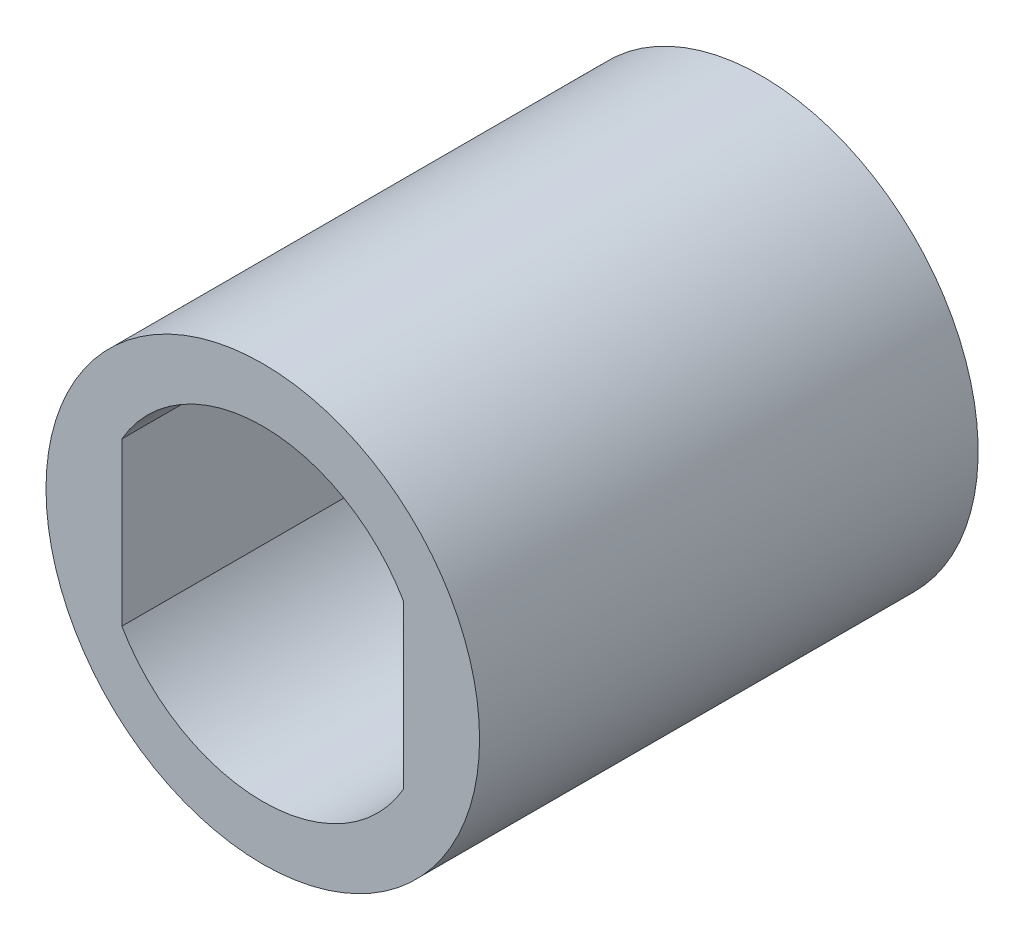
ISO-10303-21;
HEADER;
FILE_DESCRIPTION(('STEP AP214'),'2;1');
FILE_NAME('part.step','',(''),(''),'','','');
FILE_SCHEMA(('AUTOMOTIVE_DESIGN { 1 0 10303 214 1 1 1 1 }'));
ENDSEC;
DATA;
#1=APPLICATION_CONTEXT('core data for automotive mechanical design processes');
#2=APPLICATION_PROTOCOL_DEFINITION('international standard','automotive_design',2000,#1);
#3=PRODUCT_CONTEXT('',#1,'mechanical');
#4=PRODUCT('Part','Part','',(#3));
#5=PRODUCT_RELATED_PRODUCT_CATEGORY('part','',(#4));
#6=PRODUCT_DEFINITION_FORMATION('','',#4);
#7=PRODUCT_DEFINITION_CONTEXT('part definition',#1,'design');
#8=PRODUCT_DEFINITION('design','',#6,#7);
#9=PRODUCT_DEFINITION_SHAPE('','',#8);
#10=(LENGTH_UNIT() NAMED_UNIT(*) SI_UNIT(.MILLI.,.METRE.));
#11=(NAMED_UNIT(*) PLANE_ANGLE_UNIT() SI_UNIT($,.RADIAN.));
#12=(NAMED_UNIT(*) SI_UNIT($,.STERADIAN.) SOLID_ANGLE_UNIT());
#13=UNCERTAINTY_MEASURE_WITH_UNIT(LENGTH_MEASURE(1.E-05),#10,'distance_accuracy_value','');
#14=(GEOMETRIC_REPRESENTATION_CONTEXT(3) GLOBAL_UNCERTAINTY_ASSIGNED_CONTEXT((#13)) GLOBAL_UNIT_ASSIGNED_CONTEXT((#10,
#11,#12)) REPRESENTATION_CONTEXT('',''));
#15=CARTESIAN_POINT('',(0.,0.,0.));
#16=DIRECTION('',(0.,0.,1.));
#17=DIRECTION('',(1.,0.,0.));
#18=AXIS2_PLACEMENT_3D('',#15,#16,#17);
#19=CARTESIAN_POINT('',(0.,0.,18.));
#20=DIRECTION('',(0.,0.,1.));
#21=DIRECTION('',(1.,0.,0.));
#22=AXIS2_PLACEMENT_3D('',#19,#20,#21);
#23=PLANE('',#22);
#24=CARTESIAN_POINT('',(0.,0.,18.));
#25=DIRECTION('',(0.,0.,1.));
#26=DIRECTION('',(1.,0.,0.));
#27=AXIS2_PLACEMENT_3D('',#24,#25,#26);
#28=CIRCLE('',#27,10.);
#29=CARTESIAN_POINT('',(10.,0.,18.));
#30=VERTEX_POINT('',#29);
#31=EDGE_CURVE('E11',#30,#30,#28,.T.);
#32=ORIENTED_EDGE('',*,*,#31,.T.);
#33=EDGE_LOOP('',(#32));
#34=FACE_BOUND('',#33,.T.);
#35=DIRECTION('',(0.,-1.,0.));
#36=VECTOR('',#35,1.);
#37=CARTESIAN_POINT('',(-6.5,3.74165738677395,18.));
#38=LINE('',#37,#36);
#39=CARTESIAN_POINT('',(-6.5,3.74165738677395,18.));
#40=VERTEX_POINT('',#39);
#41=CARTESIAN_POINT('',(-6.5,-3.74165738677395,18.));
#42=VERTEX_POINT('',#41);
#43=EDGE_CURVE('E96',#40,#42,#38,.T.);
#44=ORIENTED_EDGE('',*,*,#43,.F.);
#45=CARTESIAN_POINT('',(0.,0.,18.));
#46=DIRECTION('',(0.,0.,1.));
#47=DIRECTION('',(1.,0.,0.));
#48=AXIS2_PLACEMENT_3D('',#45,#46,#47);
#49=CIRCLE('',#48,7.5);
#50=CARTESIAN_POINT('',(6.5,3.74165738677395,18.));
#51=VERTEX_POINT('',#50);
#52=EDGE_CURVE('E74',#51,#40,#49,.T.);
#53=ORIENTED_EDGE('',*,*,#52,.F.);
#54=DIRECTION('',(0.,1.,0.));
#55=VECTOR('',#54,1.);
#56=CARTESIAN_POINT('',(6.5,3.74165738677395,18.));
#57=LINE('',#56,#55);
#58=CARTESIAN_POINT('',(6.5,-3.74165738677395,18.));
#59=VERTEX_POINT('',#58);
#60=EDGE_CURVE('E54',#59,#51,#57,.T.);
#61=ORIENTED_EDGE('',*,*,#60,.F.);
#62=CARTESIAN_POINT('',(0.,0.,18.));
#63=DIRECTION('',(0.,0.,1.));
#64=DIRECTION('',(1.,0.,0.));
#65=AXIS2_PLACEMENT_3D('',#62,#63,#64);
#66=CIRCLE('',#65,7.5);
#67=EDGE_CURVE('E111',#42,#59,#66,.T.);
#68=ORIENTED_EDGE('',*,*,#67,.F.);
#69=EDGE_LOOP('',(#44,#53,#61,#68));
#70=FACE_BOUND('',#69,.T.);
#71=ADVANCED_FACE('F33',(#34,#70),#23,.T.);
#72=CARTESIAN_POINT('',(0.,0.,18.));
#73=DIRECTION('',(0.,0.,-1.));
#74=DIRECTION('',(-1.,0.,0.));
#75=AXIS2_PLACEMENT_3D('',#72,#73,#74);
#76=CYLINDRICAL_SURFACE('',#75,10.);
#77=ORIENTED_EDGE('',*,*,#31,.F.);
#78=EDGE_LOOP('',(#77));
#79=FACE_BOUND('',#78,.T.);
#80=CARTESIAN_POINT('',(0.,0.,-5.));
#81=DIRECTION('',(0.,0.,-1.));
#82=DIRECTION('',(-1.,0.,0.));
#83=AXIS2_PLACEMENT_3D('',#80,#81,#82);
#84=CIRCLE('',#83,10.);
#85=CARTESIAN_POINT('',(-10.,0.,-5.));
#86=VERTEX_POINT('',#85);
#87=EDGE_CURVE('E90',#86,#86,#84,.T.);
#88=ORIENTED_EDGE('',*,*,#87,.F.);
#89=EDGE_LOOP('',(#88));
#90=FACE_BOUND('',#89,.T.);
#91=ADVANCED_FACE('F35',(#79,#90),#76,.T.);
#92=CARTESIAN_POINT('',(0.,0.,18.));
#93=DIRECTION('',(0.,0.,-1.));
#94=DIRECTION('',(-1.,0.,0.));
#95=AXIS2_PLACEMENT_3D('',#92,#93,#94);
#96=CYLINDRICAL_SURFACE('',#95,7.5);
#97=CARTESIAN_POINT('',(0.,0.,0.));
#98=DIRECTION('',(0.,0.,1.));
#99=DIRECTION('',(1.,0.,0.));
#100=AXIS2_PLACEMENT_3D('',#97,#98,#99);
#101=CIRCLE('',#100,7.5);
#102=CARTESIAN_POINT('',(6.5,3.74165738677395,0.));
#103=VERTEX_POINT('',#102);
#104=CARTESIAN_POINT('',(-6.5,3.74165738677395,0.));
#105=VERTEX_POINT('',#104);
#106=EDGE_CURVE('E85',#103,#105,#101,.T.);
#107=ORIENTED_EDGE('',*,*,#106,.F.);
#108=DIRECTION('',(0.,0.,-1.));
#109=VECTOR('',#108,1.);
#110=CARTESIAN_POINT('',(6.5,3.74165738677395,18.));
#111=LINE('',#110,#109);
#112=EDGE_CURVE('E77',#51,#103,#111,.T.);
#113=ORIENTED_EDGE('',*,*,#112,.F.);
#114=ORIENTED_EDGE('',*,*,#52,.T.);
#115=DIRECTION('',(0.,0.,-1.));
#116=VECTOR('',#115,1.);
#117=CARTESIAN_POINT('',(-6.5,3.74165738677395,18.));
#118=LINE('',#117,#116);
#119=EDGE_CURVE('E41',#40,#105,#118,.T.);
#120=ORIENTED_EDGE('',*,*,#119,.T.);
#121=EDGE_LOOP('',(#107,#113,#114,#120));
#122=FACE_BOUND('',#121,.T.);
#123=ADVANCED_FACE('F86',(#122),#96,.F.);
#124=CARTESIAN_POINT('',(-6.5,3.74165738677395,18.));
#125=DIRECTION('',(1.,0.,0.));
#126=DIRECTION('',(0.,0.,-1.));
#127=AXIS2_PLACEMENT_3D('',#124,#125,#126);
#128=PLANE('',#127);
#129=DIRECTION('',(0.,-1.,0.));
#130=VECTOR('',#129,1.);
#131=CARTESIAN_POINT('',(-6.5,3.74165738677395,0.));
#132=LINE('',#131,#130);
#133=CARTESIAN_POINT('',(-6.5,-3.74165738677395,0.));
#134=VERTEX_POINT('',#133);
#135=EDGE_CURVE('E89',#105,#134,#132,.T.);
#136=ORIENTED_EDGE('',*,*,#135,.F.);
#137=ORIENTED_EDGE('',*,*,#119,.F.);
#138=ORIENTED_EDGE('',*,*,#43,.T.);
#139=DIRECTION('',(0.,0.,-1.));
#140=VECTOR('',#139,1.);
#141=CARTESIAN_POINT('',(-6.5,-3.74165738677395,18.));
#142=LINE('',#141,#140);
#143=EDGE_CURVE('E102',#42,#134,#142,.T.);
#144=ORIENTED_EDGE('',*,*,#143,.T.);
#145=EDGE_LOOP('',(#136,#137,#138,#144));
#146=FACE_BOUND('',#145,.T.);
#147=ADVANCED_FACE('F105',(#146),#128,.T.);
#148=CARTESIAN_POINT('',(0.,0.,18.));
#149=DIRECTION('',(0.,0.,-1.));
#150=DIRECTION('',(-1.,0.,0.));
#151=AXIS2_PLACEMENT_3D('',#148,#149,#150);
#152=CYLINDRICAL_SURFACE('',#151,7.5);
#153=CARTESIAN_POINT('',(0.,0.,0.));
#154=DIRECTION('',(0.,0.,1.));
#155=DIRECTION('',(1.,0.,0.));
#156=AXIS2_PLACEMENT_3D('',#153,#154,#155);
#157=CIRCLE('',#156,7.5);
#158=CARTESIAN_POINT('',(6.5,-3.74165738677395,0.));
#159=VERTEX_POINT('',#158);
#160=EDGE_CURVE('E94',#134,#159,#157,.T.);
#161=ORIENTED_EDGE('',*,*,#160,.F.);
#162=ORIENTED_EDGE('',*,*,#143,.F.);
#163=ORIENTED_EDGE('',*,*,#67,.T.);
#164=DIRECTION('',(0.,0.,-1.));
#165=VECTOR('',#164,1.);
#166=CARTESIAN_POINT('',(6.5,-3.74165738677395,18.));
#167=LINE('',#166,#165);
#168=EDGE_CURVE('E48',#59,#159,#167,.T.);
#169=ORIENTED_EDGE('',*,*,#168,.T.);
#170=EDGE_LOOP('',(#161,#162,#163,#169));
#171=FACE_BOUND('',#170,.T.);
#172=ADVANCED_FACE('F108',(#171),#152,.F.);
#173=CARTESIAN_POINT('',(6.5,3.74165738677395,18.));
#174=DIRECTION('',(-1.,0.,0.));
#175=DIRECTION('',(0.,0.,1.));
#176=AXIS2_PLACEMENT_3D('',#173,#174,#175);
#177=PLANE('',#176);
#178=DIRECTION('',(0.,1.,0.));
#179=VECTOR('',#178,1.);
#180=CARTESIAN_POINT('',(6.5,3.74165738677395,0.));
#181=LINE('',#180,#179);
#182=EDGE_CURVE('E81',#159,#103,#181,.T.);
#183=ORIENTED_EDGE('',*,*,#182,.F.);
#184=ORIENTED_EDGE('',*,*,#168,.F.);
#185=ORIENTED_EDGE('',*,*,#60,.T.);
#186=ORIENTED_EDGE('',*,*,#112,.T.);
#187=EDGE_LOOP('',(#183,#184,#185,#186));
#188=FACE_BOUND('',#187,.T.);
#189=ADVANCED_FACE('F79',(#188),#177,.T.);
#190=CARTESIAN_POINT('',(0.,0.,-5.));
#191=DIRECTION('',(0.,0.,-1.));
#192=DIRECTION('',(-1.,0.,0.));
#193=AXIS2_PLACEMENT_3D('',#190,#191,#192);
#194=PLANE('',#193);
#195=ORIENTED_EDGE('',*,*,#87,.T.);
#196=EDGE_LOOP('',(#195));
#197=FACE_BOUND('',#196,.T.);
#198=CARTESIAN_POINT('',(0.,0.,-5.));
#199=DIRECTION('',(0.,0.,-1.));
#200=DIRECTION('',(-1.,0.,0.));
#201=AXIS2_PLACEMENT_3D('',#198,#199,#200);
#202=CIRCLE('',#201,4.);
#203=CARTESIAN_POINT('',(-4.,0.,-5.));
#204=VERTEX_POINT('',#203);
#205=EDGE_CURVE('E116',#204,#204,#202,.T.);
#206=ORIENTED_EDGE('',*,*,#205,.F.);
#207=EDGE_LOOP('',(#206));
#208=FACE_BOUND('',#207,.T.);
#209=ADVANCED_FACE('F126',(#197,#208),#194,.T.);
#210=CARTESIAN_POINT('',(0.,0.,0.));
#211=DIRECTION('',(0.,0.,-1.));
#212=DIRECTION('',(-1.,0.,0.));
#213=AXIS2_PLACEMENT_3D('',#210,#211,#212);
#214=PLANE('',#213);
#215=ORIENTED_EDGE('',*,*,#106,.T.);
#216=ORIENTED_EDGE('',*,*,#135,.T.);
#217=ORIENTED_EDGE('',*,*,#160,.T.);
#218=ORIENTED_EDGE('',*,*,#182,.T.);
#219=EDGE_LOOP('',(#215,#216,#217,#218));
#220=FACE_BOUND('',#219,.T.);
#221=CARTESIAN_POINT('',(0.,0.,0.));
#222=DIRECTION('',(0.,0.,-1.));
#223=DIRECTION('',(-1.,0.,0.));
#224=AXIS2_PLACEMENT_3D('',#221,#222,#223);
#225=CIRCLE('',#224,4.);
#226=CARTESIAN_POINT('',(-4.,0.,0.));
#227=VERTEX_POINT('',#226);
#228=EDGE_CURVE('E117',#227,#227,#225,.T.);
#229=ORIENTED_EDGE('',*,*,#228,.T.);
#230=EDGE_LOOP('',(#229));
#231=FACE_BOUND('',#230,.T.);
#232=ADVANCED_FACE('F92',(#220,#231),#214,.F.);
#233=CARTESIAN_POINT('',(0.,0.,-5.));
#234=DIRECTION('',(0.,0.,1.));
#235=DIRECTION('',(1.,0.,0.));
#236=AXIS2_PLACEMENT_3D('',#233,#234,#235);
#237=CYLINDRICAL_SURFACE('',#236,4.);
#238=ORIENTED_EDGE('',*,*,#205,.T.);
#239=EDGE_LOOP('',(#238));
#240=FACE_BOUND('',#239,.T.);
#241=ORIENTED_EDGE('',*,*,#228,.F.);
#242=EDGE_LOOP('',(#241));
#243=FACE_BOUND('',#242,.T.);
#244=ADVANCED_FACE('F123',(#240,#243),#237,.F.);
#245=CLOSED_SHELL('',(#71,#91,#123,#147,#172,#189,#209,#232,#244));
#246=MANIFOLD_SOLID_BREP('B2',#245);
#247=ADVANCED_BREP_SHAPE_REPRESENTATION('',(#18,#246),#14);
#248=SHAPE_DEFINITION_REPRESENTATION(#9,#247);
ENDSEC;
END-ISO-10303-21;
